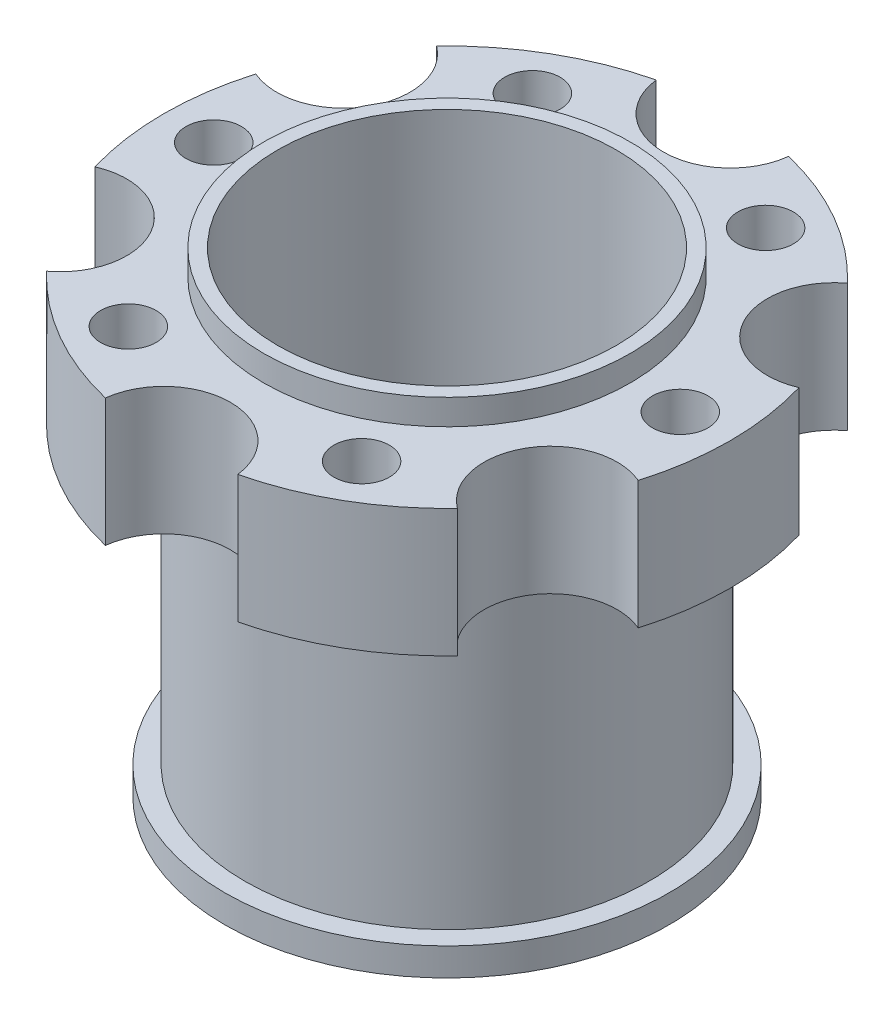
ISO-10303-21;
HEADER;
FILE_DESCRIPTION(('STEP AP214'),'2;1');
FILE_NAME('part.step','',(''),(''),'','','');
FILE_SCHEMA(('AUTOMOTIVE_DESIGN { 1 0 10303 214 1 1 1 1 }'));
ENDSEC;
DATA;
#1=APPLICATION_CONTEXT('core data for automotive mechanical design processes');
#2=APPLICATION_PROTOCOL_DEFINITION('international standard','automotive_design',2000,#1);
#3=PRODUCT_CONTEXT('',#1,'mechanical');
#4=PRODUCT('Part','Part','',(#3));
#5=PRODUCT_RELATED_PRODUCT_CATEGORY('part','',(#4));
#6=PRODUCT_DEFINITION_FORMATION('','',#4);
#7=PRODUCT_DEFINITION_CONTEXT('part definition',#1,'design');
#8=PRODUCT_DEFINITION('design','',#6,#7);
#9=PRODUCT_DEFINITION_SHAPE('','',#8);
#10=(LENGTH_UNIT() NAMED_UNIT(*) SI_UNIT(.MILLI.,.METRE.));
#11=(NAMED_UNIT(*) PLANE_ANGLE_UNIT() SI_UNIT($,.RADIAN.));
#12=(NAMED_UNIT(*) SI_UNIT($,.STERADIAN.) SOLID_ANGLE_UNIT());
#13=UNCERTAINTY_MEASURE_WITH_UNIT(LENGTH_MEASURE(1.E-05),#10,'distance_accuracy_value','');
#14=(GEOMETRIC_REPRESENTATION_CONTEXT(3) GLOBAL_UNCERTAINTY_ASSIGNED_CONTEXT((#13)) GLOBAL_UNIT_ASSIGNED_CONTEXT((#10,
#11,#12)) REPRESENTATION_CONTEXT('',''));
#15=CARTESIAN_POINT('',(0.,0.,0.));
#16=DIRECTION('',(0.,0.,1.));
#17=DIRECTION('',(1.,0.,0.));
#18=AXIS2_PLACEMENT_3D('',#15,#16,#17);
#19=CARTESIAN_POINT('',(0.,-29.,0.));
#20=DIRECTION('',(0.,-1.,0.));
#21=DIRECTION('',(0.,0.,-1.));
#22=AXIS2_PLACEMENT_3D('',#19,#20,#21);
#23=PLANE('',#22);
#24=CARTESIAN_POINT('',(0.,-29.,0.));
#25=DIRECTION('',(0.,-1.,0.));
#26=DIRECTION('',(0.,0.,-1.));
#27=AXIS2_PLACEMENT_3D('',#24,#25,#26);
#28=CIRCLE('',#27,20.);
#29=CARTESIAN_POINT('',(0.,-29.,-20.));
#30=VERTEX_POINT('',#29);
#31=EDGE_CURVE('E11',#30,#30,#28,.T.);
#32=ORIENTED_EDGE('',*,*,#31,.T.);
#33=EDGE_LOOP('',(#32));
#34=FACE_BOUND('',#33,.T.);
#35=CARTESIAN_POINT('',(0.,-29.,0.));
#36=DIRECTION('',(0.,-1.,0.));
#37=DIRECTION('',(0.,0.,-1.));
#38=AXIS2_PLACEMENT_3D('',#35,#36,#37);
#39=CIRCLE('',#38,18.2);
#40=CARTESIAN_POINT('',(0.,-29.,-18.2));
#41=VERTEX_POINT('',#40);
#42=EDGE_CURVE('E54',#41,#41,#39,.T.);
#43=ORIENTED_EDGE('',*,*,#42,.F.);
#44=EDGE_LOOP('',(#43));
#45=FACE_BOUND('',#44,.T.);
#46=ADVANCED_FACE('F43',(#34,#45),#23,.T.);
#47=CARTESIAN_POINT('',(0.,-26.5,0.));
#48=DIRECTION('',(0.,-1.,0.));
#49=DIRECTION('',(0.,0.,-1.));
#50=AXIS2_PLACEMENT_3D('',#47,#48,#49);
#51=PLANE('',#50);
#52=CARTESIAN_POINT('',(0.,-26.5,0.));
#53=DIRECTION('',(0.,-1.,0.));
#54=DIRECTION('',(0.,0.,-1.));
#55=AXIS2_PLACEMENT_3D('',#52,#53,#54);
#56=CIRCLE('',#55,20.);
#57=CARTESIAN_POINT('',(0.,-26.5,-20.));
#58=VERTEX_POINT('',#57);
#59=EDGE_CURVE('E47',#58,#58,#56,.T.);
#60=ORIENTED_EDGE('',*,*,#59,.F.);
#61=EDGE_LOOP('',(#60));
#62=FACE_BOUND('',#61,.T.);
#63=CARTESIAN_POINT('',(0.,-26.5,0.));
#64=DIRECTION('',(0.,-1.,0.));
#65=DIRECTION('',(0.,0.,-1.));
#66=AXIS2_PLACEMENT_3D('',#63,#64,#65);
#67=CIRCLE('',#66,18.2);
#68=CARTESIAN_POINT('',(0.,-26.5,-18.2));
#69=VERTEX_POINT('',#68);
#70=EDGE_CURVE('E56',#69,#69,#67,.T.);
#71=ORIENTED_EDGE('',*,*,#70,.T.);
#72=EDGE_LOOP('',(#71));
#73=FACE_BOUND('',#72,.T.);
#74=ADVANCED_FACE('F66',(#62,#73),#51,.F.);
#75=CARTESIAN_POINT('',(0.,-29.,0.));
#76=DIRECTION('',(0.,1.,0.));
#77=DIRECTION('',(0.,0.,1.));
#78=AXIS2_PLACEMENT_3D('',#75,#76,#77);
#79=CYLINDRICAL_SURFACE('',#78,20.);
#80=ORIENTED_EDGE('',*,*,#31,.F.);
#81=EDGE_LOOP('',(#80));
#82=FACE_BOUND('',#81,.T.);
#83=ORIENTED_EDGE('',*,*,#59,.T.);
#84=EDGE_LOOP('',(#83));
#85=FACE_BOUND('',#84,.T.);
#86=ADVANCED_FACE('F45',(#82,#85),#79,.T.);
#87=CARTESIAN_POINT('',(0.,-29.,0.));
#88=DIRECTION('',(0.,1.,0.));
#89=DIRECTION('',(0.,0.,1.));
#90=AXIS2_PLACEMENT_3D('',#87,#88,#89);
#91=CYLINDRICAL_SURFACE('',#90,18.2);
#92=ORIENTED_EDGE('',*,*,#42,.T.);
#93=EDGE_LOOP('',(#92));
#94=FACE_BOUND('',#93,.T.);
#95=ORIENTED_EDGE('',*,*,#70,.F.);
#96=EDGE_LOOP('',(#95));
#97=FACE_BOUND('',#96,.T.);
#98=ADVANCED_FACE('F62',(#94,#97),#91,.F.);
#99=CLOSED_SHELL('',(#46,#74,#86,#98));
#100=MANIFOLD_SOLID_BREP('B2',#99);
#101=CARTESIAN_POINT('',(0.,0.,0.));
#102=DIRECTION('',(0.,1.,0.));
#103=DIRECTION('',(0.,0.,1.));
#104=AXIS2_PLACEMENT_3D('',#101,#102,#103);
#105=PLANE('',#104);
#106=CARTESIAN_POINT('',(10.5000000000002,0.,-18.1865334794731));
#107=DIRECTION('',(0.,1.,0.));
#108=DIRECTION('',(0.,0.,1.));
#109=AXIS2_PLACEMENT_3D('',#106,#107,#108);
#110=CIRCLE('',#109,2.5);
#111=CARTESIAN_POINT('',(10.5000000000002,0.,-15.6865334794731));
#112=VERTEX_POINT('',#111);
#113=EDGE_CURVE('E382',#112,#112,#110,.T.);
#114=ORIENTED_EDGE('',*,*,#113,.T.);
#115=EDGE_LOOP('',(#114));
#116=FACE_BOUND('',#115,.T.);
#117=CARTESIAN_POINT('',(-10.4999999999998,0.,-18.1865334794733));
#118=DIRECTION('',(0.,1.,0.));
#119=DIRECTION('',(0.,0.,1.));
#120=AXIS2_PLACEMENT_3D('',#117,#118,#119);
#121=CIRCLE('',#120,2.5);
#122=CARTESIAN_POINT('',(-10.4999999999998,0.,-15.6865334794733));
#123=VERTEX_POINT('',#122);
#124=EDGE_CURVE('E386',#123,#123,#121,.T.);
#125=ORIENTED_EDGE('',*,*,#124,.T.);
#126=EDGE_LOOP('',(#125));
#127=FACE_BOUND('',#126,.T.);
#128=CARTESIAN_POINT('',(-21.,0.,-1.46642216231412E-13));
#129=DIRECTION('',(0.,1.,0.));
#130=DIRECTION('',(0.,0.,1.));
#131=AXIS2_PLACEMENT_3D('',#128,#129,#130);
#132=CIRCLE('',#131,2.5);
#133=CARTESIAN_POINT('',(-21.,0.,2.49999999999985));
#134=VERTEX_POINT('',#133);
#135=EDGE_CURVE('E395',#134,#134,#132,.T.);
#136=ORIENTED_EDGE('',*,*,#135,.T.);
#137=EDGE_LOOP('',(#136));
#138=FACE_BOUND('',#137,.T.);
#139=CARTESIAN_POINT('',(-10.5000000000001,0.,18.1865334794732));
#140=DIRECTION('',(0.,1.,0.));
#141=DIRECTION('',(0.,0.,1.));
#142=AXIS2_PLACEMENT_3D('',#139,#140,#141);
#143=CIRCLE('',#142,2.5);
#144=CARTESIAN_POINT('',(-10.5000000000001,0.,20.6865334794732));
#145=VERTEX_POINT('',#144);
#146=EDGE_CURVE('E401',#145,#145,#143,.T.);
#147=ORIENTED_EDGE('',*,*,#146,.T.);
#148=EDGE_LOOP('',(#147));
#149=FACE_BOUND('',#148,.T.);
#150=CARTESIAN_POINT('',(10.5,0.,18.1865334794732));
#151=DIRECTION('',(0.,1.,0.));
#152=DIRECTION('',(0.,0.,1.));
#153=AXIS2_PLACEMENT_3D('',#150,#151,#152);
#154=CIRCLE('',#153,2.5);
#155=CARTESIAN_POINT('',(10.5,0.,20.6865334794732));
#156=VERTEX_POINT('',#155);
#157=EDGE_CURVE('E407',#156,#156,#154,.T.);
#158=ORIENTED_EDGE('',*,*,#157,.T.);
#159=EDGE_LOOP('',(#158));
#160=FACE_BOUND('',#159,.T.);
#161=CARTESIAN_POINT('',(21.,0.,0.));
#162=DIRECTION('',(0.,1.,0.));
#163=DIRECTION('',(0.,0.,1.));
#164=AXIS2_PLACEMENT_3D('',#161,#162,#163);
#165=CIRCLE('',#164,2.5);
#166=CARTESIAN_POINT('',(21.,0.,2.5));
#167=VERTEX_POINT('',#166);
#168=EDGE_CURVE('E413',#167,#167,#165,.T.);
#169=ORIENTED_EDGE('',*,*,#168,.T.);
#170=EDGE_LOOP('',(#169));
#171=FACE_BOUND('',#170,.T.);
#172=CARTESIAN_POINT('',(0.,0.,-25.5000000000007));
#173=DIRECTION('',(0.,1.,0.));
#174=DIRECTION('',(0.,0.,1.));
#175=AXIS2_PLACEMENT_3D('',#172,#173,#174);
#176=CIRCLE('',#175,6.);
#177=CARTESIAN_POINT('',(-5.95833282922382,0.,-24.7941176470594));
#178=VERTEX_POINT('',#177);
#179=CARTESIAN_POINT('',(5.95833282922379,0.,-24.7941176470595));
#180=VERTEX_POINT('',#179);
#181=EDGE_CURVE('E224',#178,#180,#176,.T.);
#182=ORIENTED_EDGE('',*,*,#181,.T.);
#183=CARTESIAN_POINT('',(0.,0.,0.));
#184=DIRECTION('',(0.,1.,0.));
#185=DIRECTION('',(0.,0.,1.));
#186=AXIS2_PLACEMENT_3D('',#183,#184,#185);
#187=CIRCLE('',#186,25.5000000000006);
#188=CARTESIAN_POINT('',(18.4931693321611,0.,-17.5571264178401));
#189=VERTEX_POINT('',#188);
#190=EDGE_CURVE('E254',#180,#189,#187,.F.);
#191=ORIENTED_EDGE('',*,*,#190,.T.);
#192=CARTESIAN_POINT('',(22.0836477965038,0.,-12.7500000000004));
#193=DIRECTION('',(0.,1.,0.));
#194=DIRECTION('',(0.,0.,1.));
#195=AXIS2_PLACEMENT_3D('',#192,#193,#194);
#196=CIRCLE('',#195,6.00000000000009);
#197=CARTESIAN_POINT('',(24.4515021613849,0.,-7.23699122921879));
#198=VERTEX_POINT('',#197);
#199=EDGE_CURVE('E252',#189,#198,#196,.T.);
#200=ORIENTED_EDGE('',*,*,#199,.T.);
#201=CARTESIAN_POINT('',(0.,0.,0.));
#202=DIRECTION('',(0.,1.,0.));
#203=DIRECTION('',(0.,0.,1.));
#204=AXIS2_PLACEMENT_3D('',#201,#202,#203);
#205=CIRCLE('',#204,25.5000000000006);
#206=CARTESIAN_POINT('',(24.4515021613849,0.,7.23699122921878));
#207=VERTEX_POINT('',#206);
#208=EDGE_CURVE('E202',#198,#207,#205,.F.);
#209=ORIENTED_EDGE('',*,*,#208,.T.);
#210=CARTESIAN_POINT('',(22.0836477965038,0.,12.7500000000004));
#211=DIRECTION('',(0.,1.,0.));
#212=DIRECTION('',(0.,0.,1.));
#213=AXIS2_PLACEMENT_3D('',#210,#211,#212);
#214=CIRCLE('',#213,6.00000000000009);
#215=CARTESIAN_POINT('',(18.4931693321611,0.,17.55712641784));
#216=VERTEX_POINT('',#215);
#217=EDGE_CURVE('E248',#207,#216,#214,.T.);
#218=ORIENTED_EDGE('',*,*,#217,.T.);
#219=CARTESIAN_POINT('',(0.,0.,0.));
#220=DIRECTION('',(0.,1.,0.));
#221=DIRECTION('',(0.,0.,1.));
#222=AXIS2_PLACEMENT_3D('',#219,#220,#221);
#223=CIRCLE('',#222,25.5000000000006);
#224=CARTESIAN_POINT('',(5.95833282922369,0.,24.7941176470589));
#225=VERTEX_POINT('',#224);
#226=EDGE_CURVE('E245',#216,#225,#223,.F.);
#227=ORIENTED_EDGE('',*,*,#226,.T.);
#228=CARTESIAN_POINT('',(0.,0.,25.5000000000007));
#229=DIRECTION('',(0.,1.,0.));
#230=DIRECTION('',(0.,0.,1.));
#231=AXIS2_PLACEMENT_3D('',#228,#229,#230);
#232=CIRCLE('',#231,5.99999999999995);
#233=CARTESIAN_POINT('',(-5.95833282922375,0.,24.7941176470595));
#234=VERTEX_POINT('',#233);
#235=EDGE_CURVE('E242',#225,#234,#232,.T.);
#236=ORIENTED_EDGE('',*,*,#235,.T.);
#237=CARTESIAN_POINT('',(0.,0.,0.));
#238=DIRECTION('',(0.,1.,0.));
#239=DIRECTION('',(0.,0.,1.));
#240=AXIS2_PLACEMENT_3D('',#237,#238,#239);
#241=CIRCLE('',#240,25.5000000000006);
#242=CARTESIAN_POINT('',(-18.4931693321616,0.,17.5571264178404));
#243=VERTEX_POINT('',#242);
#244=EDGE_CURVE('E239',#234,#243,#241,.F.);
#245=ORIENTED_EDGE('',*,*,#244,.T.);
#246=CARTESIAN_POINT('',(-22.0836477965038,0.,12.7500000000004));
#247=DIRECTION('',(0.,1.,0.));
#248=DIRECTION('',(0.,0.,1.));
#249=AXIS2_PLACEMENT_3D('',#246,#247,#248);
#250=CIRCLE('',#249,6.);
#251=CARTESIAN_POINT('',(-24.4515021613854,0.,7.23699122921912));
#252=VERTEX_POINT('',#251);
#253=EDGE_CURVE('E236',#243,#252,#250,.T.);
#254=ORIENTED_EDGE('',*,*,#253,.T.);
#255=CARTESIAN_POINT('',(0.,0.,0.));
#256=DIRECTION('',(0.,1.,0.));
#257=DIRECTION('',(0.,0.,1.));
#258=AXIS2_PLACEMENT_3D('',#255,#256,#257);
#259=CIRCLE('',#258,25.5000000000006);
#260=CARTESIAN_POINT('',(-24.4515021613854,0.,-7.23699122921908));
#261=VERTEX_POINT('',#260);
#262=EDGE_CURVE('E233',#252,#261,#259,.F.);
#263=ORIENTED_EDGE('',*,*,#262,.T.);
#264=CARTESIAN_POINT('',(-22.0836477965038,0.,-12.7500000000003));
#265=DIRECTION('',(0.,1.,0.));
#266=DIRECTION('',(0.,0.,1.));
#267=AXIS2_PLACEMENT_3D('',#264,#265,#266);
#268=CIRCLE('',#267,6.00000000000001);
#269=CARTESIAN_POINT('',(-18.4931693321616,0.,-17.5571264178403));
#270=VERTEX_POINT('',#269);
#271=EDGE_CURVE('E230',#261,#270,#268,.T.);
#272=ORIENTED_EDGE('',*,*,#271,.T.);
#273=CARTESIAN_POINT('',(0.,0.,0.));
#274=DIRECTION('',(0.,1.,0.));
#275=DIRECTION('',(0.,0.,1.));
#276=AXIS2_PLACEMENT_3D('',#273,#274,#275);
#277=CIRCLE('',#276,25.5000000000006);
#278=EDGE_CURVE('E226',#270,#178,#277,.F.);
#279=ORIENTED_EDGE('',*,*,#278,.T.);
#280=EDGE_LOOP('',(#182,#191,#200,#209,#218,#227,#236,#245,#254,#263,#272,#279));
#281=FACE_BOUND('',#280,.T.);
#282=CARTESIAN_POINT('',(0.,0.,0.));
#283=DIRECTION('',(0.,1.,0.));
#284=DIRECTION('',(0.,0.,1.));
#285=AXIS2_PLACEMENT_3D('',#282,#283,#284);
#286=CIRCLE('',#285,18.2);
#287=CARTESIAN_POINT('',(0.,0.,18.2));
#288=VERTEX_POINT('',#287);
#289=EDGE_CURVE('E41',#288,#288,#286,.F.);
#290=ORIENTED_EDGE('',*,*,#289,.F.);
#291=EDGE_LOOP('',(#290));
#292=FACE_BOUND('',#291,.T.);
#293=ADVANCED_FACE('F105',(#116,#127,#138,#149,#160,#171,#281,#292),#105,.F.);
#294=CARTESIAN_POINT('',(0.,11.5,-25.5000000000007));
#295=DIRECTION('',(0.,-1.,0.));
#296=DIRECTION('',(0.,0.,-1.));
#297=AXIS2_PLACEMENT_3D('',#294,#295,#296);
#298=CYLINDRICAL_SURFACE('',#297,6.);
#299=ORIENTED_EDGE('',*,*,#181,.F.);
#300=DIRECTION('',(0.,-1.,0.));
#301=VECTOR('',#300,1.);
#302=CARTESIAN_POINT('',(-5.95833282922382,11.5,-24.7941176470594));
#303=LINE('',#302,#301);
#304=CARTESIAN_POINT('',(-5.95833282922382,11.5,-24.7941176470594));
#305=VERTEX_POINT('',#304);
#306=EDGE_CURVE('E114',#305,#178,#303,.T.);
#307=ORIENTED_EDGE('',*,*,#306,.F.);
#308=CARTESIAN_POINT('',(0.,11.5,-25.5000000000007));
#309=DIRECTION('',(0.,1.,0.));
#310=DIRECTION('',(0.,0.,1.));
#311=AXIS2_PLACEMENT_3D('',#308,#309,#310);
#312=CIRCLE('',#311,6.);
#313=CARTESIAN_POINT('',(5.95833282922379,11.5,-24.7941176470595));
#314=VERTEX_POINT('',#313);
#315=EDGE_CURVE('E257',#305,#314,#312,.T.);
#316=ORIENTED_EDGE('',*,*,#315,.T.);
#317=DIRECTION('',(0.,-1.,0.));
#318=VECTOR('',#317,1.);
#319=CARTESIAN_POINT('',(5.95833282922379,11.5,-24.7941176470595));
#320=LINE('',#319,#318);
#321=EDGE_CURVE('E122',#314,#180,#320,.T.);
#322=ORIENTED_EDGE('',*,*,#321,.T.);
#323=EDGE_LOOP('',(#299,#307,#316,#322));
#324=FACE_BOUND('',#323,.T.);
#325=ADVANCED_FACE('F107',(#324),#298,.F.);
#326=CARTESIAN_POINT('',(0.,11.5,0.));
#327=DIRECTION('',(0.,-1.,0.));
#328=DIRECTION('',(0.,0.,-1.));
#329=AXIS2_PLACEMENT_3D('',#326,#327,#328);
#330=CYLINDRICAL_SURFACE('',#329,25.5000000000006);
#331=ORIENTED_EDGE('',*,*,#278,.F.);
#332=DIRECTION('',(0.,-1.,0.));
#333=VECTOR('',#332,1.);
#334=CARTESIAN_POINT('',(-18.4931693321616,11.5,-17.5571264178403));
#335=LINE('',#334,#333);
#336=CARTESIAN_POINT('',(-18.4931693321616,11.5,-17.5571264178403));
#337=VERTEX_POINT('',#336);
#338=EDGE_CURVE('E273',#337,#270,#335,.T.);
#339=ORIENTED_EDGE('',*,*,#338,.F.);
#340=CARTESIAN_POINT('',(0.,11.5,0.));
#341=DIRECTION('',(0.,1.,0.));
#342=DIRECTION('',(0.,0.,1.));
#343=AXIS2_PLACEMENT_3D('',#340,#341,#342);
#344=CIRCLE('',#343,25.5000000000006);
#345=EDGE_CURVE('E279',#337,#305,#344,.F.);
#346=ORIENTED_EDGE('',*,*,#345,.T.);
#347=ORIENTED_EDGE('',*,*,#306,.T.);
#348=EDGE_LOOP('',(#331,#339,#346,#347));
#349=FACE_BOUND('',#348,.T.);
#350=ADVANCED_FACE('F277',(#349),#330,.T.);
#351=CARTESIAN_POINT('',(-22.0836477965038,11.5,-12.7500000000003));
#352=DIRECTION('',(0.,-1.,0.));
#353=DIRECTION('',(0.,0.,-1.));
#354=AXIS2_PLACEMENT_3D('',#351,#352,#353);
#355=CYLINDRICAL_SURFACE('',#354,6.00000000000001);
#356=ORIENTED_EDGE('',*,*,#271,.F.);
#357=DIRECTION('',(0.,-1.,0.));
#358=VECTOR('',#357,1.);
#359=CARTESIAN_POINT('',(-24.4515021613854,11.5,-7.23699122921908));
#360=LINE('',#359,#358);
#361=CARTESIAN_POINT('',(-24.4515021613854,11.5,-7.23699122921908));
#362=VERTEX_POINT('',#361);
#363=EDGE_CURVE('E271',#362,#261,#360,.T.);
#364=ORIENTED_EDGE('',*,*,#363,.F.);
#365=CARTESIAN_POINT('',(-22.0836477965038,11.5,-12.7500000000003));
#366=DIRECTION('',(0.,1.,0.));
#367=DIRECTION('',(0.,0.,1.));
#368=AXIS2_PLACEMENT_3D('',#365,#366,#367);
#369=CIRCLE('',#368,6.00000000000001);
#370=EDGE_CURVE('E288',#362,#337,#369,.T.);
#371=ORIENTED_EDGE('',*,*,#370,.T.);
#372=ORIENTED_EDGE('',*,*,#338,.T.);
#373=EDGE_LOOP('',(#356,#364,#371,#372));
#374=FACE_BOUND('',#373,.T.);
#375=ADVANCED_FACE('F285',(#374),#355,.F.);
#376=CARTESIAN_POINT('',(0.,11.5,0.));
#377=DIRECTION('',(0.,-1.,0.));
#378=DIRECTION('',(0.,0.,-1.));
#379=AXIS2_PLACEMENT_3D('',#376,#377,#378);
#380=CYLINDRICAL_SURFACE('',#379,25.5000000000006);
#381=ORIENTED_EDGE('',*,*,#262,.F.);
#382=DIRECTION('',(0.,-1.,0.));
#383=VECTOR('',#382,1.);
#384=CARTESIAN_POINT('',(-24.4515021613854,11.5,7.23699122921912));
#385=LINE('',#384,#383);
#386=CARTESIAN_POINT('',(-24.4515021613854,11.5,7.23699122921912));
#387=VERTEX_POINT('',#386);
#388=EDGE_CURVE('E269',#387,#252,#385,.T.);
#389=ORIENTED_EDGE('',*,*,#388,.F.);
#390=CARTESIAN_POINT('',(0.,11.5,0.));
#391=DIRECTION('',(0.,1.,0.));
#392=DIRECTION('',(0.,0.,1.));
#393=AXIS2_PLACEMENT_3D('',#390,#391,#392);
#394=CIRCLE('',#393,25.5000000000006);
#395=EDGE_CURVE('E292',#387,#362,#394,.F.);
#396=ORIENTED_EDGE('',*,*,#395,.T.);
#397=ORIENTED_EDGE('',*,*,#363,.T.);
#398=EDGE_LOOP('',(#381,#389,#396,#397));
#399=FACE_BOUND('',#398,.T.);
#400=ADVANCED_FACE('F601',(#399),#380,.T.);
#401=CARTESIAN_POINT('',(-22.0836477965038,11.5,12.7500000000004));
#402=DIRECTION('',(0.,-1.,0.));
#403=DIRECTION('',(0.,0.,-1.));
#404=AXIS2_PLACEMENT_3D('',#401,#402,#403);
#405=CYLINDRICAL_SURFACE('',#404,6.);
#406=ORIENTED_EDGE('',*,*,#253,.F.);
#407=DIRECTION('',(0.,-1.,0.));
#408=VECTOR('',#407,1.);
#409=CARTESIAN_POINT('',(-18.4931693321616,11.5,17.5571264178404));
#410=LINE('',#409,#408);
#411=CARTESIAN_POINT('',(-18.4931693321616,11.5,17.5571264178404));
#412=VERTEX_POINT('',#411);
#413=EDGE_CURVE('E267',#412,#243,#410,.T.);
#414=ORIENTED_EDGE('',*,*,#413,.F.);
#415=CARTESIAN_POINT('',(-22.0836477965038,11.5,12.7500000000004));
#416=DIRECTION('',(0.,1.,0.));
#417=DIRECTION('',(0.,0.,1.));
#418=AXIS2_PLACEMENT_3D('',#415,#416,#417);
#419=CIRCLE('',#418,6.);
#420=EDGE_CURVE('E298',#412,#387,#419,.T.);
#421=ORIENTED_EDGE('',*,*,#420,.T.);
#422=ORIENTED_EDGE('',*,*,#388,.T.);
#423=EDGE_LOOP('',(#406,#414,#421,#422));
#424=FACE_BOUND('',#423,.T.);
#425=ADVANCED_FACE('F592',(#424),#405,.F.);
#426=CARTESIAN_POINT('',(0.,11.5,0.));
#427=DIRECTION('',(0.,-1.,0.));
#428=DIRECTION('',(0.,0.,-1.));
#429=AXIS2_PLACEMENT_3D('',#426,#427,#428);
#430=CYLINDRICAL_SURFACE('',#429,25.5000000000006);
#431=ORIENTED_EDGE('',*,*,#244,.F.);
#432=DIRECTION('',(0.,-1.,0.));
#433=VECTOR('',#432,1.);
#434=CARTESIAN_POINT('',(-5.95833282922375,11.5,24.7941176470595));
#435=LINE('',#434,#433);
#436=CARTESIAN_POINT('',(-5.95833282922375,11.5,24.7941176470595));
#437=VERTEX_POINT('',#436);
#438=EDGE_CURVE('E265',#437,#234,#435,.T.);
#439=ORIENTED_EDGE('',*,*,#438,.F.);
#440=CARTESIAN_POINT('',(0.,11.5,0.));
#441=DIRECTION('',(0.,1.,0.));
#442=DIRECTION('',(0.,0.,1.));
#443=AXIS2_PLACEMENT_3D('',#440,#441,#442);
#444=CIRCLE('',#443,25.5000000000006);
#445=EDGE_CURVE('E301',#437,#412,#444,.F.);
#446=ORIENTED_EDGE('',*,*,#445,.T.);
#447=ORIENTED_EDGE('',*,*,#413,.T.);
#448=EDGE_LOOP('',(#431,#439,#446,#447));
#449=FACE_BOUND('',#448,.T.);
#450=ADVANCED_FACE('F583',(#449),#430,.T.);
#451=CARTESIAN_POINT('',(0.,11.5,25.5000000000007));
#452=DIRECTION('',(0.,-1.,0.));
#453=DIRECTION('',(0.,0.,-1.));
#454=AXIS2_PLACEMENT_3D('',#451,#452,#453);
#455=CYLINDRICAL_SURFACE('',#454,5.99999999999995);
#456=ORIENTED_EDGE('',*,*,#235,.F.);
#457=DIRECTION('',(0.,-1.,0.));
#458=VECTOR('',#457,1.);
#459=CARTESIAN_POINT('',(5.95833282922369,11.5,24.7941176470589));
#460=LINE('',#459,#458);
#461=CARTESIAN_POINT('',(5.95833282922369,11.5,24.7941176470589));
#462=VERTEX_POINT('',#461);
#463=EDGE_CURVE('E263',#462,#225,#460,.T.);
#464=ORIENTED_EDGE('',*,*,#463,.F.);
#465=CARTESIAN_POINT('',(0.,11.5,25.5000000000007));
#466=DIRECTION('',(0.,1.,0.));
#467=DIRECTION('',(0.,0.,1.));
#468=AXIS2_PLACEMENT_3D('',#465,#466,#467);
#469=CIRCLE('',#468,5.99999999999995);
#470=EDGE_CURVE('E304',#462,#437,#469,.T.);
#471=ORIENTED_EDGE('',*,*,#470,.T.);
#472=ORIENTED_EDGE('',*,*,#438,.T.);
#473=EDGE_LOOP('',(#456,#464,#471,#472));
#474=FACE_BOUND('',#473,.T.);
#475=ADVANCED_FACE('F574',(#474),#455,.F.);
#476=CARTESIAN_POINT('',(0.,11.5,0.));
#477=DIRECTION('',(0.,-1.,0.));
#478=DIRECTION('',(0.,0.,-1.));
#479=AXIS2_PLACEMENT_3D('',#476,#477,#478);
#480=CYLINDRICAL_SURFACE('',#479,25.5000000000006);
#481=ORIENTED_EDGE('',*,*,#226,.F.);
#482=DIRECTION('',(0.,-1.,0.));
#483=VECTOR('',#482,1.);
#484=CARTESIAN_POINT('',(18.4931693321611,11.5,17.55712641784));
#485=LINE('',#484,#483);
#486=CARTESIAN_POINT('',(18.4931693321611,11.5,17.55712641784));
#487=VERTEX_POINT('',#486);
#488=EDGE_CURVE('E261',#487,#216,#485,.T.);
#489=ORIENTED_EDGE('',*,*,#488,.F.);
#490=CARTESIAN_POINT('',(0.,11.5,0.));
#491=DIRECTION('',(0.,1.,0.));
#492=DIRECTION('',(0.,0.,1.));
#493=AXIS2_PLACEMENT_3D('',#490,#491,#492);
#494=CIRCLE('',#493,25.5000000000006);
#495=EDGE_CURVE('E307',#487,#462,#494,.F.);
#496=ORIENTED_EDGE('',*,*,#495,.T.);
#497=ORIENTED_EDGE('',*,*,#463,.T.);
#498=EDGE_LOOP('',(#481,#489,#496,#497));
#499=FACE_BOUND('',#498,.T.);
#500=ADVANCED_FACE('F566',(#499),#480,.T.);
#501=CARTESIAN_POINT('',(22.0836477965038,11.5,12.7500000000004));
#502=DIRECTION('',(0.,-1.,0.));
#503=DIRECTION('',(0.,0.,-1.));
#504=AXIS2_PLACEMENT_3D('',#501,#502,#503);
#505=CYLINDRICAL_SURFACE('',#504,6.00000000000009);
#506=ORIENTED_EDGE('',*,*,#217,.F.);
#507=DIRECTION('',(0.,-1.,0.));
#508=VECTOR('',#507,1.);
#509=CARTESIAN_POINT('',(24.4515021613849,11.5,7.23699122921878));
#510=LINE('',#509,#508);
#511=CARTESIAN_POINT('',(24.4515021613849,11.5,7.23699122921878));
#512=VERTEX_POINT('',#511);
#513=EDGE_CURVE('E206',#512,#207,#510,.T.);
#514=ORIENTED_EDGE('',*,*,#513,.F.);
#515=CARTESIAN_POINT('',(22.0836477965038,11.5,12.7500000000004));
#516=DIRECTION('',(0.,1.,0.));
#517=DIRECTION('',(0.,0.,1.));
#518=AXIS2_PLACEMENT_3D('',#515,#516,#517);
#519=CIRCLE('',#518,6.00000000000009);
#520=EDGE_CURVE('E216',#512,#487,#519,.T.);
#521=ORIENTED_EDGE('',*,*,#520,.T.);
#522=ORIENTED_EDGE('',*,*,#488,.T.);
#523=EDGE_LOOP('',(#506,#514,#521,#522));
#524=FACE_BOUND('',#523,.T.);
#525=ADVANCED_FACE('F311',(#524),#505,.F.);
#526=CARTESIAN_POINT('',(0.,11.5,0.));
#527=DIRECTION('',(0.,-1.,0.));
#528=DIRECTION('',(0.,0.,-1.));
#529=AXIS2_PLACEMENT_3D('',#526,#527,#528);
#530=CYLINDRICAL_SURFACE('',#529,25.5000000000006);
#531=ORIENTED_EDGE('',*,*,#208,.F.);
#532=DIRECTION('',(0.,-1.,0.));
#533=VECTOR('',#532,1.);
#534=CARTESIAN_POINT('',(24.4515021613849,11.5,-7.23699122921879));
#535=LINE('',#534,#533);
#536=CARTESIAN_POINT('',(24.4515021613849,11.5,-7.23699122921879));
#537=VERTEX_POINT('',#536);
#538=EDGE_CURVE('E197',#537,#198,#535,.T.);
#539=ORIENTED_EDGE('',*,*,#538,.F.);
#540=CARTESIAN_POINT('',(0.,11.5,0.));
#541=DIRECTION('',(0.,1.,0.));
#542=DIRECTION('',(0.,0.,1.));
#543=AXIS2_PLACEMENT_3D('',#540,#541,#542);
#544=CIRCLE('',#543,25.5000000000006);
#545=EDGE_CURVE('E200',#537,#512,#544,.F.);
#546=ORIENTED_EDGE('',*,*,#545,.T.);
#547=ORIENTED_EDGE('',*,*,#513,.T.);
#548=EDGE_LOOP('',(#531,#539,#546,#547));
#549=FACE_BOUND('',#548,.T.);
#550=ADVANCED_FACE('F199',(#549),#530,.T.);
#551=CARTESIAN_POINT('',(22.0836477965038,11.5,-12.7500000000004));
#552=DIRECTION('',(0.,-1.,0.));
#553=DIRECTION('',(0.,0.,-1.));
#554=AXIS2_PLACEMENT_3D('',#551,#552,#553);
#555=CYLINDRICAL_SURFACE('',#554,6.00000000000009);
#556=ORIENTED_EDGE('',*,*,#199,.F.);
#557=DIRECTION('',(0.,-1.,0.));
#558=VECTOR('',#557,1.);
#559=CARTESIAN_POINT('',(18.4931693321611,11.5,-17.5571264178401));
#560=LINE('',#559,#558);
#561=CARTESIAN_POINT('',(18.4931693321611,11.5,-17.5571264178401));
#562=VERTEX_POINT('',#561);
#563=EDGE_CURVE('E160',#562,#189,#560,.T.);
#564=ORIENTED_EDGE('',*,*,#563,.F.);
#565=CARTESIAN_POINT('',(22.0836477965038,11.5,-12.7500000000004));
#566=DIRECTION('',(0.,1.,0.));
#567=DIRECTION('',(0.,0.,1.));
#568=AXIS2_PLACEMENT_3D('',#565,#566,#567);
#569=CIRCLE('',#568,6.00000000000009);
#570=EDGE_CURVE('E213',#562,#537,#569,.T.);
#571=ORIENTED_EDGE('',*,*,#570,.T.);
#572=ORIENTED_EDGE('',*,*,#538,.T.);
#573=EDGE_LOOP('',(#556,#564,#571,#572));
#574=FACE_BOUND('',#573,.T.);
#575=ADVANCED_FACE('F218',(#574),#555,.F.);
#576=CARTESIAN_POINT('',(0.,11.5,0.));
#577=DIRECTION('',(0.,-1.,0.));
#578=DIRECTION('',(0.,0.,-1.));
#579=AXIS2_PLACEMENT_3D('',#576,#577,#578);
#580=CYLINDRICAL_SURFACE('',#579,25.5000000000006);
#581=ORIENTED_EDGE('',*,*,#190,.F.);
#582=ORIENTED_EDGE('',*,*,#321,.F.);
#583=CARTESIAN_POINT('',(0.,11.5,0.));
#584=DIRECTION('',(0.,1.,0.));
#585=DIRECTION('',(0.,0.,1.));
#586=AXIS2_PLACEMENT_3D('',#583,#584,#585);
#587=CIRCLE('',#586,25.5000000000006);
#588=EDGE_CURVE('E219',#314,#562,#587,.F.);
#589=ORIENTED_EDGE('',*,*,#588,.T.);
#590=ORIENTED_EDGE('',*,*,#563,.T.);
#591=EDGE_LOOP('',(#581,#582,#589,#590));
#592=FACE_BOUND('',#591,.T.);
#593=ADVANCED_FACE('F313',(#592),#580,.T.);
#594=CARTESIAN_POINT('',(0.,11.5,0.));
#595=DIRECTION('',(0.,1.,0.));
#596=DIRECTION('',(0.,0.,1.));
#597=AXIS2_PLACEMENT_3D('',#594,#595,#596);
#598=PLANE('',#597);
#599=CARTESIAN_POINT('',(10.5000000000002,11.5,-18.1865334794731));
#600=DIRECTION('',(0.,1.,0.));
#601=DIRECTION('',(0.,0.,1.));
#602=AXIS2_PLACEMENT_3D('',#599,#600,#601);
#603=CIRCLE('',#602,2.5);
#604=CARTESIAN_POINT('',(10.5000000000002,11.5,-15.6865334794731));
#605=VERTEX_POINT('',#604);
#606=EDGE_CURVE('E380',#605,#605,#603,.T.);
#607=ORIENTED_EDGE('',*,*,#606,.F.);
#608=EDGE_LOOP('',(#607));
#609=FACE_BOUND('',#608,.T.);
#610=CARTESIAN_POINT('',(-10.4999999999998,11.5,-18.1865334794733));
#611=DIRECTION('',(0.,1.,0.));
#612=DIRECTION('',(0.,0.,1.));
#613=AXIS2_PLACEMENT_3D('',#610,#611,#612);
#614=CIRCLE('',#613,2.5);
#615=CARTESIAN_POINT('',(-10.4999999999998,11.5,-15.6865334794733));
#616=VERTEX_POINT('',#615);
#617=EDGE_CURVE('E383',#616,#616,#614,.T.);
#618=ORIENTED_EDGE('',*,*,#617,.F.);
#619=EDGE_LOOP('',(#618));
#620=FACE_BOUND('',#619,.T.);
#621=CARTESIAN_POINT('',(-21.,11.5,-1.46642216231412E-13));
#622=DIRECTION('',(0.,1.,0.));
#623=DIRECTION('',(0.,0.,1.));
#624=AXIS2_PLACEMENT_3D('',#621,#622,#623);
#625=CIRCLE('',#624,2.5);
#626=CARTESIAN_POINT('',(-21.,11.5,2.49999999999985));
#627=VERTEX_POINT('',#626);
#628=EDGE_CURVE('E392',#627,#627,#625,.T.);
#629=ORIENTED_EDGE('',*,*,#628,.F.);
#630=EDGE_LOOP('',(#629));
#631=FACE_BOUND('',#630,.T.);
#632=CARTESIAN_POINT('',(-10.5000000000001,11.5,18.1865334794732));
#633=DIRECTION('',(0.,1.,0.));
#634=DIRECTION('',(0.,0.,1.));
#635=AXIS2_PLACEMENT_3D('',#632,#633,#634);
#636=CIRCLE('',#635,2.5);
#637=CARTESIAN_POINT('',(-10.5000000000001,11.5,20.6865334794732));
#638=VERTEX_POINT('',#637);
#639=EDGE_CURVE('E398',#638,#638,#636,.T.);
#640=ORIENTED_EDGE('',*,*,#639,.F.);
#641=EDGE_LOOP('',(#640));
#642=FACE_BOUND('',#641,.T.);
#643=CARTESIAN_POINT('',(10.5,11.5,18.1865334794732));
#644=DIRECTION('',(0.,1.,0.));
#645=DIRECTION('',(0.,0.,1.));
#646=AXIS2_PLACEMENT_3D('',#643,#644,#645);
#647=CIRCLE('',#646,2.5);
#648=CARTESIAN_POINT('',(10.5,11.5,20.6865334794732));
#649=VERTEX_POINT('',#648);
#650=EDGE_CURVE('E404',#649,#649,#647,.T.);
#651=ORIENTED_EDGE('',*,*,#650,.F.);
#652=EDGE_LOOP('',(#651));
#653=FACE_BOUND('',#652,.T.);
#654=CARTESIAN_POINT('',(21.,11.5,0.));
#655=DIRECTION('',(0.,1.,0.));
#656=DIRECTION('',(0.,0.,1.));
#657=AXIS2_PLACEMENT_3D('',#654,#655,#656);
#658=CIRCLE('',#657,2.5);
#659=CARTESIAN_POINT('',(21.,11.5,2.5));
#660=VERTEX_POINT('',#659);
#661=EDGE_CURVE('E410',#660,#660,#658,.T.);
#662=ORIENTED_EDGE('',*,*,#661,.F.);
#663=EDGE_LOOP('',(#662));
#664=FACE_BOUND('',#663,.T.);
#665=CARTESIAN_POINT('',(0.,11.5,0.));
#666=DIRECTION('',(0.,1.,0.));
#667=DIRECTION('',(0.,0.,1.));
#668=AXIS2_PLACEMENT_3D('',#665,#666,#667);
#669=CIRCLE('',#668,16.5);
#670=CARTESIAN_POINT('',(0.,11.5,16.5));
#671=VERTEX_POINT('',#670);
#672=EDGE_CURVE('E425',#671,#671,#669,.T.);
#673=ORIENTED_EDGE('',*,*,#672,.F.);
#674=EDGE_LOOP('',(#673));
#675=FACE_BOUND('',#674,.T.);
#676=ORIENTED_EDGE('',*,*,#315,.F.);
#677=ORIENTED_EDGE('',*,*,#345,.F.);
#678=ORIENTED_EDGE('',*,*,#370,.F.);
#679=ORIENTED_EDGE('',*,*,#395,.F.);
#680=ORIENTED_EDGE('',*,*,#420,.F.);
#681=ORIENTED_EDGE('',*,*,#445,.F.);
#682=ORIENTED_EDGE('',*,*,#470,.F.);
#683=ORIENTED_EDGE('',*,*,#495,.F.);
#684=ORIENTED_EDGE('',*,*,#520,.F.);
#685=ORIENTED_EDGE('',*,*,#545,.F.);
#686=ORIENTED_EDGE('',*,*,#570,.F.);
#687=ORIENTED_EDGE('',*,*,#588,.F.);
#688=EDGE_LOOP('',(#676,#677,#678,#679,#680,#681,#682,#683,#684,#685,#686,#687));
#689=FACE_BOUND('',#688,.T.);
#690=ADVANCED_FACE('F211',(#609,#620,#631,#642,#653,#664,#675,#689),#598,.T.);
#691=CARTESIAN_POINT('',(0.,13.8,0.));
#692=DIRECTION('',(0.,1.,0.));
#693=DIRECTION('',(0.,0.,1.));
#694=AXIS2_PLACEMENT_3D('',#691,#692,#693);
#695=PLANE('',#694);
#696=CARTESIAN_POINT('',(0.,13.8,0.));
#697=DIRECTION('',(0.,1.,0.));
#698=DIRECTION('',(0.,0.,1.));
#699=AXIS2_PLACEMENT_3D('',#696,#697,#698);
#700=CIRCLE('',#699,16.5);
#701=CARTESIAN_POINT('',(0.,13.8,16.5));
#702=VERTEX_POINT('',#701);
#703=EDGE_CURVE('E227',#702,#702,#700,.T.);
#704=ORIENTED_EDGE('',*,*,#703,.T.);
#705=EDGE_LOOP('',(#704));
#706=FACE_BOUND('',#705,.T.);
#707=CARTESIAN_POINT('',(0.,13.8,0.));
#708=DIRECTION('',(0.,1.,0.));
#709=DIRECTION('',(0.,0.,1.));
#710=AXIS2_PLACEMENT_3D('',#707,#708,#709);
#711=CIRCLE('',#710,15.25);
#712=CARTESIAN_POINT('',(0.,13.8,15.25));
#713=VERTEX_POINT('',#712);
#714=EDGE_CURVE('E422',#713,#713,#711,.T.);
#715=ORIENTED_EDGE('',*,*,#714,.F.);
#716=EDGE_LOOP('',(#715));
#717=FACE_BOUND('',#716,.T.);
#718=ADVANCED_FACE('F320',(#706,#717),#695,.T.);
#719=CARTESIAN_POINT('',(0.,13.8,0.));
#720=DIRECTION('',(0.,-1.,0.));
#721=DIRECTION('',(0.,0.,-1.));
#722=AXIS2_PLACEMENT_3D('',#719,#720,#721);
#723=CYLINDRICAL_SURFACE('',#722,16.5);
#724=ORIENTED_EDGE('',*,*,#703,.F.);
#725=EDGE_LOOP('',(#724));
#726=FACE_BOUND('',#725,.T.);
#727=ORIENTED_EDGE('',*,*,#672,.T.);
#728=EDGE_LOOP('',(#727));
#729=FACE_BOUND('',#728,.T.);
#730=ADVANCED_FACE('F333',(#726,#729),#723,.T.);
#731=CARTESIAN_POINT('',(0.,13.8,0.));
#732=DIRECTION('',(0.,-1.,0.));
#733=DIRECTION('',(0.,0.,-1.));
#734=AXIS2_PLACEMENT_3D('',#731,#732,#733);
#735=CYLINDRICAL_SURFACE('',#734,15.25);
#736=ORIENTED_EDGE('',*,*,#714,.T.);
#737=EDGE_LOOP('',(#736));
#738=FACE_BOUND('',#737,.T.);
#739=CARTESIAN_POINT('',(0.,-26.5,0.));
#740=DIRECTION('',(0.,-1.,0.));
#741=DIRECTION('',(0.,0.,-1.));
#742=AXIS2_PLACEMENT_3D('',#739,#740,#741);
#743=CIRCLE('',#742,15.25);
#744=CARTESIAN_POINT('',(0.,-26.5,-15.25));
#745=VERTEX_POINT('',#744);
#746=EDGE_CURVE('E416',#745,#745,#743,.T.);
#747=ORIENTED_EDGE('',*,*,#746,.T.);
#748=EDGE_LOOP('',(#747));
#749=FACE_BOUND('',#748,.T.);
#750=ADVANCED_FACE('F336',(#738,#749),#735,.F.);
#751=CARTESIAN_POINT('',(0.,-26.5,0.));
#752=DIRECTION('',(0.,-1.,0.));
#753=DIRECTION('',(0.,0.,-1.));
#754=AXIS2_PLACEMENT_3D('',#751,#752,#753);
#755=PLANE('',#754);
#756=CARTESIAN_POINT('',(0.,-26.5,0.));
#757=DIRECTION('',(0.,-1.,0.));
#758=DIRECTION('',(0.,0.,-1.));
#759=AXIS2_PLACEMENT_3D('',#756,#757,#758);
#760=CIRCLE('',#759,18.2);
#761=CARTESIAN_POINT('',(0.,-26.5,-18.2));
#762=VERTEX_POINT('',#761);
#763=EDGE_CURVE('E419',#762,#762,#760,.T.);
#764=ORIENTED_EDGE('',*,*,#763,.T.);
#765=EDGE_LOOP('',(#764));
#766=FACE_BOUND('',#765,.T.);
#767=ORIENTED_EDGE('',*,*,#746,.F.);
#768=EDGE_LOOP('',(#767));
#769=FACE_BOUND('',#768,.T.);
#770=ADVANCED_FACE('F343',(#766,#769),#755,.T.);
#771=CARTESIAN_POINT('',(0.,-26.5,0.));
#772=DIRECTION('',(0.,1.,0.));
#773=DIRECTION('',(0.,0.,1.));
#774=AXIS2_PLACEMENT_3D('',#771,#772,#773);
#775=CYLINDRICAL_SURFACE('',#774,18.2);
#776=ORIENTED_EDGE('',*,*,#763,.F.);
#777=EDGE_LOOP('',(#776));
#778=FACE_BOUND('',#777,.T.);
#779=ORIENTED_EDGE('',*,*,#289,.T.);
#780=EDGE_LOOP('',(#779));
#781=FACE_BOUND('',#780,.T.);
#782=ADVANCED_FACE('F345',(#778,#781),#775,.T.);
#783=CARTESIAN_POINT('',(21.,-7.5,0.));
#784=DIRECTION('',(0.,1.,0.));
#785=DIRECTION('',(0.,0.,1.));
#786=AXIS2_PLACEMENT_3D('',#783,#784,#785);
#787=CYLINDRICAL_SURFACE('',#786,2.5);
#788=ORIENTED_EDGE('',*,*,#661,.T.);
#789=EDGE_LOOP('',(#788));
#790=FACE_BOUND('',#789,.T.);
#791=ORIENTED_EDGE('',*,*,#168,.F.);
#792=EDGE_LOOP('',(#791));
#793=FACE_BOUND('',#792,.T.);
#794=ADVANCED_FACE('F348',(#790,#793),#787,.F.);
#795=CARTESIAN_POINT('',(10.5,-7.5,18.1865334794732));
#796=DIRECTION('',(0.,1.,0.));
#797=DIRECTION('',(0.,0.,1.));
#798=AXIS2_PLACEMENT_3D('',#795,#796,#797);
#799=CYLINDRICAL_SURFACE('',#798,2.5);
#800=ORIENTED_EDGE('',*,*,#650,.T.);
#801=EDGE_LOOP('',(#800));
#802=FACE_BOUND('',#801,.T.);
#803=ORIENTED_EDGE('',*,*,#157,.F.);
#804=EDGE_LOOP('',(#803));
#805=FACE_BOUND('',#804,.T.);
#806=ADVANCED_FACE('F355',(#802,#805),#799,.F.);
#807=CARTESIAN_POINT('',(-10.5000000000001,-7.5,18.1865334794732));
#808=DIRECTION('',(0.,1.,0.));
#809=DIRECTION('',(0.,0.,1.));
#810=AXIS2_PLACEMENT_3D('',#807,#808,#809);
#811=CYLINDRICAL_SURFACE('',#810,2.5);
#812=ORIENTED_EDGE('',*,*,#639,.T.);
#813=EDGE_LOOP('',(#812));
#814=FACE_BOUND('',#813,.T.);
#815=ORIENTED_EDGE('',*,*,#146,.F.);
#816=EDGE_LOOP('',(#815));
#817=FACE_BOUND('',#816,.T.);
#818=ADVANCED_FACE('F359',(#814,#817),#811,.F.);
#819=CARTESIAN_POINT('',(-21.,-7.5,-1.46642216231412E-13));
#820=DIRECTION('',(0.,1.,0.));
#821=DIRECTION('',(0.,0.,1.));
#822=AXIS2_PLACEMENT_3D('',#819,#820,#821);
#823=CYLINDRICAL_SURFACE('',#822,2.5);
#824=ORIENTED_EDGE('',*,*,#628,.T.);
#825=EDGE_LOOP('',(#824));
#826=FACE_BOUND('',#825,.T.);
#827=ORIENTED_EDGE('',*,*,#135,.F.);
#828=EDGE_LOOP('',(#827));
#829=FACE_BOUND('',#828,.T.);
#830=ADVANCED_FACE('F363',(#826,#829),#823,.F.);
#831=CARTESIAN_POINT('',(-10.4999999999998,-7.5,-18.1865334794733));
#832=DIRECTION('',(0.,1.,0.));
#833=DIRECTION('',(0.,0.,1.));
#834=AXIS2_PLACEMENT_3D('',#831,#832,#833);
#835=CYLINDRICAL_SURFACE('',#834,2.5);
#836=ORIENTED_EDGE('',*,*,#617,.T.);
#837=EDGE_LOOP('',(#836));
#838=FACE_BOUND('',#837,.T.);
#839=ORIENTED_EDGE('',*,*,#124,.F.);
#840=EDGE_LOOP('',(#839));
#841=FACE_BOUND('',#840,.T.);
#842=ADVANCED_FACE('F367',(#838,#841),#835,.F.);
#843=CARTESIAN_POINT('',(10.5000000000002,-7.5,-18.1865334794731));
#844=DIRECTION('',(0.,1.,0.));
#845=DIRECTION('',(0.,0.,1.));
#846=AXIS2_PLACEMENT_3D('',#843,#844,#845);
#847=CYLINDRICAL_SURFACE('',#846,2.5);
#848=ORIENTED_EDGE('',*,*,#606,.T.);
#849=EDGE_LOOP('',(#848));
#850=FACE_BOUND('',#849,.T.);
#851=ORIENTED_EDGE('',*,*,#113,.F.);
#852=EDGE_LOOP('',(#851));
#853=FACE_BOUND('',#852,.T.);
#854=ADVANCED_FACE('F371',(#850,#853),#847,.F.);
#855=CLOSED_SHELL('',(#293,#325,#350,#375,#400,#425,#450,#475,#500,#525,#550,#575,#593,#690,
#718,#730,#750,#770,#782,#794,#806,#818,#830,#842,#854));
#856=MANIFOLD_SOLID_BREP('B6',#855);
#857=ADVANCED_BREP_SHAPE_REPRESENTATION('',(#18,#100,#856),#14);
#858=SHAPE_DEFINITION_REPRESENTATION(#9,#857);
ENDSEC;
END-ISO-10303-21;
